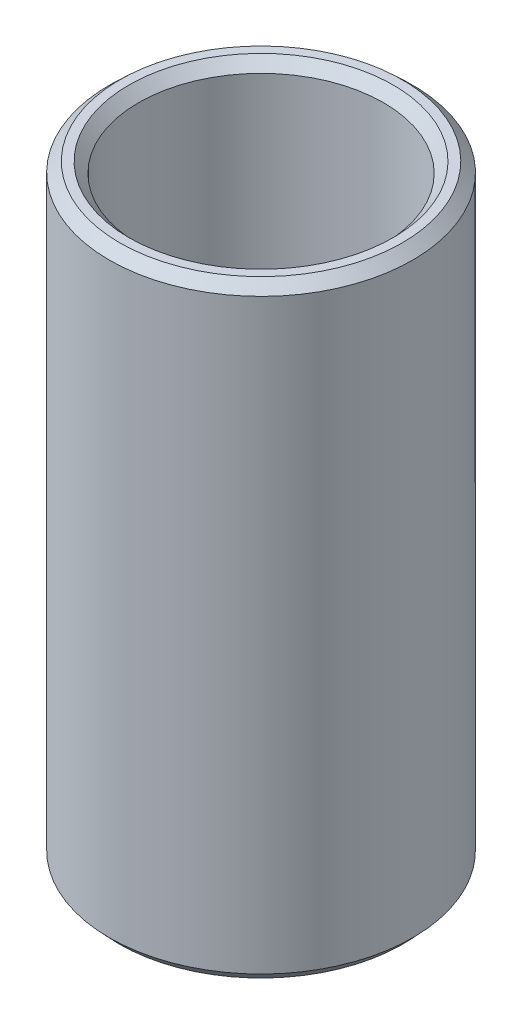
ISO-10303-21;
HEADER;
FILE_DESCRIPTION(('STEP AP214'),'2;1');
FILE_NAME('part.step','',(''),(''),'','','');
FILE_SCHEMA(('AUTOMOTIVE_DESIGN { 1 0 10303 214 1 1 1 1 }'));
ENDSEC;
DATA;
#1=APPLICATION_CONTEXT('core data for automotive mechanical design processes');
#2=APPLICATION_PROTOCOL_DEFINITION('international standard','automotive_design',2000,#1);
#3=PRODUCT_CONTEXT('',#1,'mechanical');
#4=PRODUCT('Part','Part','',(#3));
#5=PRODUCT_RELATED_PRODUCT_CATEGORY('part','',(#4));
#6=PRODUCT_DEFINITION_FORMATION('','',#4);
#7=PRODUCT_DEFINITION_CONTEXT('part definition',#1,'design');
#8=PRODUCT_DEFINITION('design','',#6,#7);
#9=PRODUCT_DEFINITION_SHAPE('','',#8);
#10=(LENGTH_UNIT() NAMED_UNIT(*) SI_UNIT(.MILLI.,.METRE.));
#11=(NAMED_UNIT(*) PLANE_ANGLE_UNIT() SI_UNIT($,.RADIAN.));
#12=(NAMED_UNIT(*) SI_UNIT($,.STERADIAN.) SOLID_ANGLE_UNIT());
#13=UNCERTAINTY_MEASURE_WITH_UNIT(LENGTH_MEASURE(1.E-05),#10,'distance_accuracy_value','');
#14=(GEOMETRIC_REPRESENTATION_CONTEXT(3) GLOBAL_UNCERTAINTY_ASSIGNED_CONTEXT((#13)) GLOBAL_UNIT_ASSIGNED_CONTEXT((#10,
#11,#12)) REPRESENTATION_CONTEXT('',''));
#15=CARTESIAN_POINT('',(0.,0.,0.));
#16=DIRECTION('',(0.,0.,1.));
#17=DIRECTION('',(1.,0.,0.));
#18=AXIS2_PLACEMENT_3D('',#15,#16,#17);
#19=CARTESIAN_POINT('',(0.,230.197861075307,0.));
#20=DIRECTION('',(0.,-1.,0.));
#21=DIRECTION('',(0.,0.,-1.));
#22=AXIS2_PLACEMENT_3D('',#19,#20,#21);
#23=CYLINDRICAL_SURFACE('',#22,57.5);
#24=CARTESIAN_POINT('',(0.,3.93528089474746,0.));
#25=DIRECTION('',(0.,1.,0.));
#26=DIRECTION('',(0.,0.,1.));
#27=AXIS2_PLACEMENT_3D('',#24,#25,#26);
#28=CIRCLE('',#27,57.5);
#29=CARTESIAN_POINT('',(0.,3.93528089474746,57.5));
#30=VERTEX_POINT('',#29);
#31=EDGE_CURVE('E10',#30,#30,#28,.T.);
#32=ORIENTED_EDGE('',*,*,#31,.T.);
#33=EDGE_LOOP('',(#32));
#34=FACE_BOUND('',#33,.T.);
#35=CARTESIAN_POINT('',(0.,226.490298116945,0.));
#36=DIRECTION('',(0.,1.,0.));
#37=DIRECTION('',(0.,0.,1.));
#38=AXIS2_PLACEMENT_3D('',#35,#36,#37);
#39=CIRCLE('',#38,57.5);
#40=CARTESIAN_POINT('',(0.,226.490298116945,57.5));
#41=VERTEX_POINT('',#40);
#42=EDGE_CURVE('E50',#41,#41,#39,.F.);
#43=ORIENTED_EDGE('',*,*,#42,.T.);
#44=EDGE_LOOP('',(#43));
#45=FACE_BOUND('',#44,.T.);
#46=ADVANCED_FACE('F39',(#34,#45),#23,.T.);
#47=CARTESIAN_POINT('',(0.,230.197861075307,0.));
#48=DIRECTION('',(0.,1.,0.));
#49=DIRECTION('',(0.,0.,1.));
#50=AXIS2_PLACEMENT_3D('',#47,#48,#49);
#51=PLANE('',#50);
#52=CARTESIAN_POINT('',(0.,230.197861075307,0.));
#53=DIRECTION('',(0.,1.,0.));
#54=DIRECTION('',(0.,0.,1.));
#55=AXIS2_PLACEMENT_3D('',#52,#53,#54);
#56=CIRCLE('',#55,50.1369593853855);
#57=CARTESIAN_POINT('',(0.,230.197861075307,50.1369593853855));
#58=VERTEX_POINT('',#57);
#59=EDGE_CURVE('E58',#58,#58,#56,.F.);
#60=ORIENTED_EDGE('',*,*,#59,.T.);
#61=EDGE_LOOP('',(#60));
#62=FACE_BOUND('',#61,.T.);
#63=CARTESIAN_POINT('',(0.,230.197861075307,0.));
#64=DIRECTION('',(0.,1.,0.));
#65=DIRECTION('',(0.,0.,1.));
#66=AXIS2_PLACEMENT_3D('',#63,#64,#65);
#67=CIRCLE('',#66,53.5647191052525);
#68=CARTESIAN_POINT('',(0.,230.197861075307,53.5647191052525));
#69=VERTEX_POINT('',#68);
#70=EDGE_CURVE('E61',#69,#69,#67,.T.);
#71=ORIENTED_EDGE('',*,*,#70,.T.);
#72=EDGE_LOOP('',(#71));
#73=FACE_BOUND('',#72,.T.);
#74=ADVANCED_FACE('F88',(#62,#73),#51,.T.);
#75=CARTESIAN_POINT('',(0.,0.,0.));
#76=DIRECTION('',(0.,1.,0.));
#77=DIRECTION('',(0.,0.,1.));
#78=AXIS2_PLACEMENT_3D('',#75,#76,#77);
#79=PLANE('',#78);
#80=CARTESIAN_POINT('',(0.,0.,0.));
#81=DIRECTION('',(0.,1.,0.));
#82=DIRECTION('',(0.,0.,1.));
#83=AXIS2_PLACEMENT_3D('',#80,#81,#82);
#84=CIRCLE('',#83,50.3646773217709);
#85=CARTESIAN_POINT('',(0.,0.,50.3646773217709));
#86=VERTEX_POINT('',#85);
#87=EDGE_CURVE('E51',#86,#86,#84,.T.);
#88=ORIENTED_EDGE('',*,*,#87,.T.);
#89=EDGE_LOOP('',(#88));
#90=FACE_BOUND('',#89,.T.);
#91=CARTESIAN_POINT('',(0.,0.,0.));
#92=DIRECTION('',(0.,1.,0.));
#93=DIRECTION('',(0.,0.,1.));
#94=AXIS2_PLACEMENT_3D('',#91,#92,#93);
#95=CIRCLE('',#94,53.792437041638);
#96=CARTESIAN_POINT('',(0.,0.,53.792437041638));
#97=VERTEX_POINT('',#96);
#98=EDGE_CURVE('E54',#97,#97,#95,.F.);
#99=ORIENTED_EDGE('',*,*,#98,.T.);
#100=EDGE_LOOP('',(#99));
#101=FACE_BOUND('',#100,.T.);
#102=ADVANCED_FACE('F83',(#90,#101),#79,.F.);
#103=CARTESIAN_POINT('',(0.,230.197861075307,0.));
#104=DIRECTION('',(0.,-1.,0.));
#105=DIRECTION('',(0.,0.,-1.));
#106=AXIS2_PLACEMENT_3D('',#103,#104,#105);
#107=CYLINDRICAL_SURFACE('',#106,46.4293964270233);
#108=CARTESIAN_POINT('',(0.,226.262580180559,0.));
#109=DIRECTION('',(0.,1.,0.));
#110=DIRECTION('',(0.,0.,1.));
#111=AXIS2_PLACEMENT_3D('',#108,#109,#110);
#112=CIRCLE('',#111,46.4293964270233);
#113=CARTESIAN_POINT('',(0.,226.262580180559,46.4293964270233));
#114=VERTEX_POINT('',#113);
#115=EDGE_CURVE('E67',#114,#114,#112,.T.);
#116=ORIENTED_EDGE('',*,*,#115,.T.);
#117=EDGE_LOOP('',(#116));
#118=FACE_BOUND('',#117,.T.);
#119=CARTESIAN_POINT('',(0.,3.70756295836211,0.));
#120=DIRECTION('',(0.,1.,0.));
#121=DIRECTION('',(0.,0.,1.));
#122=AXIS2_PLACEMENT_3D('',#119,#120,#121);
#123=CIRCLE('',#122,46.4293964270233);
#124=CARTESIAN_POINT('',(0.,3.70756295836211,46.4293964270233));
#125=VERTEX_POINT('',#124);
#126=EDGE_CURVE('E69',#125,#125,#123,.F.);
#127=ORIENTED_EDGE('',*,*,#126,.T.);
#128=EDGE_LOOP('',(#127));
#129=FACE_BOUND('',#128,.T.);
#130=ADVANCED_FACE('F71',(#118,#129),#107,.F.);
#131=CARTESIAN_POINT('',(0.,226.262580180559,0.));
#132=DIRECTION('',(0.,1.,0.));
#133=DIRECTION('',(0.,0.,1.));
#134=AXIS2_PLACEMENT_3D('',#131,#132,#133);
#135=CONICAL_SURFACE('',#134,46.4293964270233,0.755612053402868);
#136=ORIENTED_EDGE('',*,*,#59,.F.);
#137=EDGE_LOOP('',(#136));
#138=FACE_BOUND('',#137,.T.);
#139=ORIENTED_EDGE('',*,*,#115,.F.);
#140=EDGE_LOOP('',(#139));
#141=FACE_BOUND('',#140,.T.);
#142=ADVANCED_FACE('F77',(#138,#141),#135,.F.);
#143=CARTESIAN_POINT('',(0.,0.,0.));
#144=DIRECTION('',(0.,-1.,0.));
#145=DIRECTION('',(0.,0.,-1.));
#146=AXIS2_PLACEMENT_3D('',#143,#144,#145);
#147=CONICAL_SURFACE('',#146,50.3646773217709,0.815184273392028);
#148=ORIENTED_EDGE('',*,*,#126,.F.);
#149=EDGE_LOOP('',(#148));
#150=FACE_BOUND('',#149,.T.);
#151=ORIENTED_EDGE('',*,*,#87,.F.);
#152=EDGE_LOOP('',(#151));
#153=FACE_BOUND('',#152,.T.);
#154=ADVANCED_FACE('F73',(#150,#153),#147,.F.);
#155=CARTESIAN_POINT('',(0.,3.93528089474746,0.));
#156=DIRECTION('',(0.,1.,0.));
#157=DIRECTION('',(0.,0.,1.));
#158=AXIS2_PLACEMENT_3D('',#155,#156,#157);
#159=CONICAL_SURFACE('',#158,57.5,0.755612053402872);
#160=ORIENTED_EDGE('',*,*,#98,.F.);
#161=EDGE_LOOP('',(#160));
#162=FACE_BOUND('',#161,.T.);
#163=ORIENTED_EDGE('',*,*,#31,.F.);
#164=EDGE_LOOP('',(#163));
#165=FACE_BOUND('',#164,.T.);
#166=ADVANCED_FACE('F76',(#162,#165),#159,.T.);
#167=CARTESIAN_POINT('',(0.,230.197861075307,0.));
#168=DIRECTION('',(0.,-1.,0.));
#169=DIRECTION('',(0.,0.,-1.));
#170=AXIS2_PLACEMENT_3D('',#167,#168,#169);
#171=CONICAL_SURFACE('',#170,53.5647191052525,0.815184273392026);
#172=ORIENTED_EDGE('',*,*,#42,.F.);
#173=EDGE_LOOP('',(#172));
#174=FACE_BOUND('',#173,.T.);
#175=ORIENTED_EDGE('',*,*,#70,.F.);
#176=EDGE_LOOP('',(#175));
#177=FACE_BOUND('',#176,.T.);
#178=ADVANCED_FACE('F45',(#174,#177),#171,.T.);
#179=CLOSED_SHELL('',(#46,#74,#102,#130,#142,#154,#166,#178));
#180=MANIFOLD_SOLID_BREP('B2',#179);
#181=ADVANCED_BREP_SHAPE_REPRESENTATION('',(#18,#180),#14);
#182=SHAPE_DEFINITION_REPRESENTATION(#9,#181);
ENDSEC;
END-ISO-10303-21;
